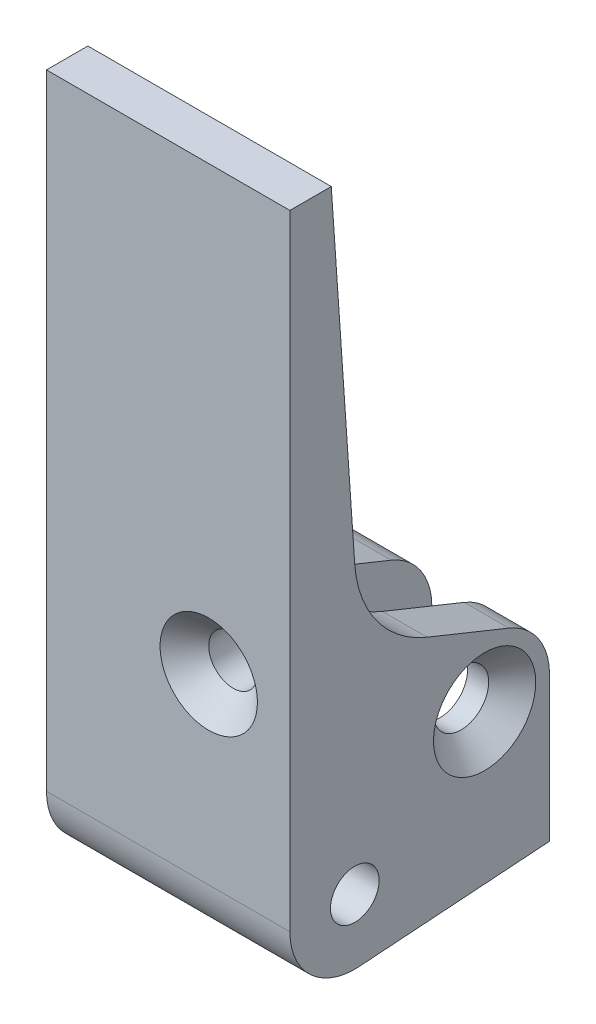
ISO-10303-21;
HEADER;
FILE_DESCRIPTION(('STEP AP214'),'2;1');
FILE_NAME('part.step','',(''),(''),'','','');
FILE_SCHEMA(('AUTOMOTIVE_DESIGN { 1 0 10303 214 1 1 1 1 }'));
ENDSEC;
DATA;
#1=APPLICATION_CONTEXT('core data for automotive mechanical design processes');
#2=APPLICATION_PROTOCOL_DEFINITION('international standard','automotive_design',2000,#1);
#3=PRODUCT_CONTEXT('',#1,'mechanical');
#4=PRODUCT('Part','Part','',(#3));
#5=PRODUCT_RELATED_PRODUCT_CATEGORY('part','',(#4));
#6=PRODUCT_DEFINITION_FORMATION('','',#4);
#7=PRODUCT_DEFINITION_CONTEXT('part definition',#1,'design');
#8=PRODUCT_DEFINITION('design','',#6,#7);
#9=PRODUCT_DEFINITION_SHAPE('','',#8);
#10=(LENGTH_UNIT() NAMED_UNIT(*) SI_UNIT(.MILLI.,.METRE.));
#11=(NAMED_UNIT(*) PLANE_ANGLE_UNIT() SI_UNIT($,.RADIAN.));
#12=(NAMED_UNIT(*) SI_UNIT($,.STERADIAN.) SOLID_ANGLE_UNIT());
#13=UNCERTAINTY_MEASURE_WITH_UNIT(LENGTH_MEASURE(1.E-05),#10,'distance_accuracy_value','');
#14=(GEOMETRIC_REPRESENTATION_CONTEXT(3) GLOBAL_UNCERTAINTY_ASSIGNED_CONTEXT((#13)) GLOBAL_UNIT_ASSIGNED_CONTEXT((#10,
#11,#12)) REPRESENTATION_CONTEXT('',''));
#15=CARTESIAN_POINT('',(0.,0.,0.));
#16=DIRECTION('',(0.,0.,1.));
#17=DIRECTION('',(1.,0.,0.));
#18=AXIS2_PLACEMENT_3D('',#15,#16,#17);
#19=CARTESIAN_POINT('',(4.7833911777,-22.5652643177,178.13));
#20=DIRECTION('',(1.,0.,0.));
#21=DIRECTION('',(0.,0.,-1.));
#22=AXIS2_PLACEMENT_3D('',#19,#20,#21);
#23=CYLINDRICAL_SURFACE('',#22,1.7);
#24=CARTESIAN_POINT('',(3.33339117764808,-22.5652643177,178.13));
#25=DIRECTION('',(1.,0.,0.));
#26=DIRECTION('',(0.,-1.,0.));
#27=AXIS2_PLACEMENT_3D('',#24,#25,#26);
#28=CIRCLE('',#27,1.70000000000526);
#29=CARTESIAN_POINT('',(3.33339117764808,-24.2652643177053,178.13));
#30=VERTEX_POINT('',#29);
#31=EDGE_CURVE('E153',#30,#30,#28,.T.);
#32=ORIENTED_EDGE('',*,*,#31,.T.);
#33=EDGE_LOOP('',(#32));
#34=FACE_BOUND('',#33,.T.);
#35=CARTESIAN_POINT('',(2.0333911777,-22.5652643177,178.13));
#36=DIRECTION('',(1.,0.,0.));
#37=DIRECTION('',(0.,0.,-1.));
#38=AXIS2_PLACEMENT_3D('',#35,#36,#37);
#39=CIRCLE('',#38,1.7);
#40=CARTESIAN_POINT('',(2.0333911777,-22.5652643177,176.43));
#41=VERTEX_POINT('',#40);
#42=EDGE_CURVE('E19',#41,#41,#39,.T.);
#43=ORIENTED_EDGE('',*,*,#42,.F.);
#44=EDGE_LOOP('',(#43));
#45=FACE_BOUND('',#44,.T.);
#46=ADVANCED_FACE('F16',(#34,#45),#23,.F.);
#47=CARTESIAN_POINT('',(-2.4666088223,-7.5652643177,174.13));
#48=DIRECTION('',(1.,0.,0.));
#49=DIRECTION('',(0.,0.,-1.));
#50=AXIS2_PLACEMENT_3D('',#47,#48,#49);
#51=PLANE('',#50);
#52=CARTESIAN_POINT('',(-2.4666088223,-22.5652643177,178.13));
#53=DIRECTION('',(-1.,0.,0.));
#54=DIRECTION('',(0.,0.,1.));
#55=AXIS2_PLACEMENT_3D('',#52,#53,#54);
#56=CIRCLE('',#55,1.23);
#57=CARTESIAN_POINT('',(-2.4666088223,-22.5652643177,179.36));
#58=VERTEX_POINT('',#57);
#59=EDGE_CURVE('E141',#58,#58,#56,.T.);
#60=ORIENTED_EDGE('',*,*,#59,.T.);
#61=EDGE_LOOP('',(#60));
#62=FACE_BOUND('',#61,.T.);
#63=DIRECTION('',(0.,1.,0.));
#64=VECTOR('',#63,1.);
#65=CARTESIAN_POINT('',(-2.4666088223,-7.5652643177,183.63));
#66=LINE('',#65,#64);
#67=CARTESIAN_POINT('',(-2.4666088223,-32.1500925049505,183.63));
#68=VERTEX_POINT('',#67);
#69=CARTESIAN_POINT('',(-2.4666088223,-15.6375789270996,183.63));
#70=VERTEX_POINT('',#69);
#71=EDGE_CURVE('E167',#68,#70,#66,.T.);
#72=ORIENTED_EDGE('',*,*,#71,.F.);
#73=DIRECTION('',(0.,0.0698111742334551,-0.99756022372193));
#74=VECTOR('',#73,1.);
#75=CARTESIAN_POINT('',(-2.4666088223,-32.30550521258,185.85075530306));
#76=LINE('',#75,#74);
#77=CARTESIAN_POINT('',(-2.4666088223,-31.4852643176952,174.13));
#78=VERTEX_POINT('',#77);
#79=EDGE_CURVE('E152',#78,#68,#76,.F.);
#80=ORIENTED_EDGE('',*,*,#79,.F.);
#81=DIRECTION('',(0.,1.,0.));
#82=VECTOR('',#81,1.);
#83=CARTESIAN_POINT('',(-2.4666088223,-31.4852643177,174.13));
#84=LINE('',#83,#82);
#85=CARTESIAN_POINT('',(-2.4666088223,-22.5652643177,174.13));
#86=VERTEX_POINT('',#85);
#87=EDGE_CURVE('E142',#86,#78,#84,.F.);
#88=ORIENTED_EDGE('',*,*,#87,.F.);
#89=CARTESIAN_POINT('',(-2.4666088223,-22.5652643177,178.13));
#90=DIRECTION('',(1.,0.,0.));
#91=DIRECTION('',(0.,0.,-1.));
#92=AXIS2_PLACEMENT_3D('',#89,#90,#91);
#93=CIRCLE('',#92,4.);
#94=CARTESIAN_POINT('',(-2.4666088223,-18.8565288994314,176.631573626333));
#95=VERTEX_POINT('',#94);
#96=EDGE_CURVE('E146',#95,#86,#93,.F.);
#97=ORIENTED_EDGE('',*,*,#96,.F.);
#98=DIRECTION('',(0.,0.374606593415914,0.927183854566787));
#99=VECTOR('',#98,1.);
#100=CARTESIAN_POINT('',(-2.4666088223,-18.85652889943,176.63157362633));
#101=LINE('',#100,#99);
#102=CARTESIAN_POINT('',(-2.4666088223,-16.8165288994311,181.680750807302));
#103=VERTEX_POINT('',#102);
#104=EDGE_CURVE('E104',#103,#95,#101,.F.);
#105=ORIENTED_EDGE('',*,*,#104,.F.);
#106=CARTESIAN_POINT('',(-2.4666088223,-10.18716433928,179.00231366438));
#107=DIRECTION('',(1.,0.,0.));
#108=DIRECTION('',(0.,0.,-1.));
#109=AXIS2_PLACEMENT_3D('',#106,#107,#108);
#110=CIRCLE('',#109,7.15);
#111=EDGE_CURVE('E122',#103,#70,#110,.F.);
#112=ORIENTED_EDGE('',*,*,#111,.T.);
#113=EDGE_LOOP('',(#72,#80,#88,#97,#105,#112));
#114=FACE_BOUND('',#113,.T.);
#115=ADVANCED_FACE('F423',(#62,#114),#51,.T.);
#116=CARTESIAN_POINT('',(-2.4666088223,-7.5652643177,183.63));
#117=DIRECTION('',(0.,0.,-1.));
#118=DIRECTION('',(-1.,0.,0.));
#119=AXIS2_PLACEMENT_3D('',#116,#117,#118);
#120=PLANE('',#119);
#121=DIRECTION('',(0.,1.,0.));
#122=VECTOR('',#121,1.);
#123=CARTESIAN_POINT('',(2.0333911777,-37.5652643177,183.63));
#124=LINE('',#123,#122);
#125=CARTESIAN_POINT('',(2.0333911777,-32.1500925049505,183.63));
#126=VERTEX_POINT('',#125);
#127=CARTESIAN_POINT('',(2.0333911777,-15.6375789270996,183.63));
#128=VERTEX_POINT('',#127);
#129=EDGE_CURVE('E165',#126,#128,#124,.T.);
#130=ORIENTED_EDGE('',*,*,#129,.F.);
#131=DIRECTION('',(1.,0.,0.));
#132=VECTOR('',#131,1.);
#133=CARTESIAN_POINT('',(4.7833911777,-32.1500925049508,183.63));
#134=LINE('',#133,#132);
#135=EDGE_CURVE('E172',#68,#126,#134,.T.);
#136=ORIENTED_EDGE('',*,*,#135,.F.);
#137=ORIENTED_EDGE('',*,*,#71,.T.);
#138=DIRECTION('',(1.,0.,0.));
#139=VECTOR('',#138,1.);
#140=CARTESIAN_POINT('',(4.7833911777,-15.6375789270997,183.63));
#141=LINE('',#140,#139);
#142=CARTESIAN_POINT('',(-0.676733180997008,-15.6375789270997,183.63));
#143=VERTEX_POINT('',#142);
#144=EDGE_CURVE('E93',#70,#143,#141,.T.);
#145=ORIENTED_EDGE('',*,*,#144,.T.);
#146=CARTESIAN_POINT('',(-0.216608822299998,-17.0652643177,183.63));
#147=DIRECTION('',(0.,0.,-1.));
#148=DIRECTION('',(-1.,0.,0.));
#149=AXIS2_PLACEMENT_3D('',#146,#147,#148);
#150=CIRCLE('',#149,1.5);
#151=CARTESIAN_POINT('',(0.243515536398897,-15.6375789271003,183.629999999999));
#152=VERTEX_POINT('',#151);
#153=EDGE_CURVE('E95',#143,#152,#150,.F.);
#154=ORIENTED_EDGE('',*,*,#153,.T.);
#155=DIRECTION('',(1.,0.,0.));
#156=VECTOR('',#155,1.);
#157=CARTESIAN_POINT('',(4.7833911777,-15.6375789270997,183.63));
#158=LINE('',#157,#156);
#159=EDGE_CURVE('E100',#152,#128,#158,.T.);
#160=ORIENTED_EDGE('',*,*,#159,.T.);
#161=EDGE_LOOP('',(#130,#136,#137,#145,#154,#160));
#162=FACE_BOUND('',#161,.T.);
#163=ADVANCED_FACE('F98',(#162),#120,.T.);
#164=CARTESIAN_POINT('',(2.0333911777,-37.5652643177,174.13));
#165=DIRECTION('',(-1.,0.,0.));
#166=DIRECTION('',(0.,0.,1.));
#167=AXIS2_PLACEMENT_3D('',#164,#165,#166);
#168=PLANE('',#167);
#169=ORIENTED_EDGE('',*,*,#42,.T.);
#170=EDGE_LOOP('',(#169));
#171=FACE_BOUND('',#170,.T.);
#172=DIRECTION('',(0.,0.374606593415914,0.927183854566787));
#173=VECTOR('',#172,1.);
#174=CARTESIAN_POINT('',(2.0333911777,-18.85652889943,176.63157362633));
#175=LINE('',#174,#173);
#176=CARTESIAN_POINT('',(2.0333911777,-18.8565288994314,176.631573626333));
#177=VERTEX_POINT('',#176);
#178=CARTESIAN_POINT('',(2.0333911777,-16.8165288994292,181.680750807301));
#179=VERTEX_POINT('',#178);
#180=EDGE_CURVE('E115',#177,#179,#175,.T.);
#181=ORIENTED_EDGE('',*,*,#180,.F.);
#182=CARTESIAN_POINT('',(2.0333911777,-22.5652643177,178.13));
#183=DIRECTION('',(1.,0.,0.));
#184=DIRECTION('',(0.,0.,-1.));
#185=AXIS2_PLACEMENT_3D('',#182,#183,#184);
#186=CIRCLE('',#185,4.);
#187=CARTESIAN_POINT('',(2.0333911777,-22.5652643177,174.13));
#188=VERTEX_POINT('',#187);
#189=EDGE_CURVE('E233',#188,#177,#186,.T.);
#190=ORIENTED_EDGE('',*,*,#189,.F.);
#191=DIRECTION('',(0.,1.,0.));
#192=VECTOR('',#191,1.);
#193=CARTESIAN_POINT('',(2.0333911777,-31.4852643177,174.13));
#194=LINE('',#193,#192);
#195=CARTESIAN_POINT('',(2.0333911777,-31.4852643176976,174.13));
#196=VERTEX_POINT('',#195);
#197=EDGE_CURVE('E159',#196,#188,#194,.T.);
#198=ORIENTED_EDGE('',*,*,#197,.F.);
#199=DIRECTION('',(0.,0.0698111742334551,-0.99756022372193));
#200=VECTOR('',#199,1.);
#201=CARTESIAN_POINT('',(2.0333911777,-32.30550521258,185.85075530306));
#202=LINE('',#201,#200);
#203=EDGE_CURVE('E126',#126,#196,#202,.T.);
#204=ORIENTED_EDGE('',*,*,#203,.F.);
#205=ORIENTED_EDGE('',*,*,#129,.T.);
#206=CARTESIAN_POINT('',(2.0333911777,-10.18716433928,179.00231366438));
#207=DIRECTION('',(1.,0.,0.));
#208=DIRECTION('',(0.,0.,-1.));
#209=AXIS2_PLACEMENT_3D('',#206,#207,#208);
#210=CIRCLE('',#209,7.15);
#211=EDGE_CURVE('E113',#128,#179,#210,.T.);
#212=ORIENTED_EDGE('',*,*,#211,.T.);
#213=EDGE_LOOP('',(#181,#190,#198,#204,#205,#212));
#214=FACE_BOUND('',#213,.T.);
#215=ADVANCED_FACE('F282',(#171,#214),#168,.T.);
#216=CARTESIAN_POINT('',(-0.2166088223,-17.0652643177,174.13));
#217=DIRECTION('',(0.,0.,-1.));
#218=DIRECTION('',(-1.,0.,0.));
#219=AXIS2_PLACEMENT_3D('',#216,#217,#218);
#220=CYLINDRICAL_SURFACE('',#219,1.5);
#221=CARTESIAN_POINT('',(-0.676733181001063,-15.637578927101,183.629999999998));
#222=CARTESIAN_POINT('',(-0.650771673570297,-15.629211048905,183.639855117339));
#223=CARTESIAN_POINT('',(-0.624316941741797,-15.6214685913466,183.648920446191));
#224=CARTESIAN_POINT('',(-0.570524402255945,-15.6073485935759,183.665383529604));
#225=CARTESIAN_POINT('',(-0.543186156110636,-15.6009717434693,183.672780441137));
#226=CARTESIAN_POINT('',(-0.460178960592109,-15.5841006381388,183.692290320695));
#227=CARTESIAN_POINT('',(-0.403387540746469,-15.5758231451973,183.701772241588));
#228=CARTESIAN_POINT('',(-0.288284372336391,-15.5658593146001,183.713173496685));
#229=CARTESIAN_POINT('',(-0.22996782855515,-15.5641971607047,183.715065083034));
#230=CARTESIAN_POINT('',(-0.113811856029325,-15.5676649618612,183.711105336005));
#231=CARTESIAN_POINT('',(-0.0559722209989535,-15.5727918064788,183.705257548483));
#232=CARTESIAN_POINT('',(0.0427993259321904,-15.5872523306482,183.688637855935));
#233=CARTESIAN_POINT('',(0.0842404756621355,-15.5951578396799,183.679527414588));
#234=CARTESIAN_POINT('',(0.165336078860807,-15.6141053053487,183.657526989911));
#235=CARTESIAN_POINT('',(0.204991823832572,-15.6251449512059,183.644639790937));
#236=CARTESIAN_POINT('',(0.24351553640106,-15.637578927101,183.629999999998));
#237=B_SPLINE_CURVE_WITH_KNOTS('',3,(#221,#222,#223,#224,#225,#226,#227,#228,#229,#230,#231,
#232,#233,#234,#235,#236),.UNSPECIFIED.,.F.,.F.,(4,2,2,2,2,2,2,4),(0.,0.0869672276078167,
0.173978300677935,0.347568835720363,0.521793387681531,0.695938144875291,0.825114326468509,
0.954195513505102),.UNSPECIFIED.);
#238=EDGE_CURVE('E105',#143,#152,#237,.T.);
#239=ORIENTED_EDGE('',*,*,#238,.T.);
#240=ORIENTED_EDGE('',*,*,#153,.F.);
#241=EDGE_LOOP('',(#239,#240));
#242=FACE_BOUND('',#241,.T.);
#243=CARTESIAN_POINT('',(-0.2166088223,-17.0652643177,188.629999999989));
#244=DIRECTION('',(0.,0.,1.));
#245=DIRECTION('',(0.,-1.,0.));
#246=AXIS2_PLACEMENT_3D('',#243,#244,#245);
#247=CIRCLE('',#246,1.50000000001499);
#248=CARTESIAN_POINT('',(-0.216608822299996,-18.565264317715,188.629999999989));
#249=VERTEX_POINT('',#248);
#250=EDGE_CURVE('E131',#249,#249,#247,.T.);
#251=ORIENTED_EDGE('',*,*,#250,.T.);
#252=EDGE_LOOP('',(#251));
#253=FACE_BOUND('',#252,.T.);
#254=ADVANCED_FACE('F106',(#242,#253),#220,.F.);
#255=CARTESIAN_POINT('',(4.7833911777,-18.85652889943,176.63157362633));
#256=DIRECTION('',(0.,0.927183854566787,-0.374606593415914));
#257=DIRECTION('',(0.,0.374606593415914,0.927183854566787));
#258=AXIS2_PLACEMENT_3D('',#255,#256,#257);
#259=PLANE('',#258);
#260=DIRECTION('',(0.,-0.374606593415863,-0.927183854566807));
#261=VECTOR('',#260,1.);
#262=CARTESIAN_POINT('',(-10.2166088223,-16.81652889943,181.6807508073));
#263=LINE('',#262,#261);
#264=CARTESIAN_POINT('',(-10.2166088223,-16.8165288994313,181.680750807302));
#265=VERTEX_POINT('',#264);
#266=CARTESIAN_POINT('',(-10.2166088223,-18.8565288994314,176.631573626333));
#267=VERTEX_POINT('',#266);
#268=EDGE_CURVE('E228',#265,#267,#263,.T.);
#269=ORIENTED_EDGE('',*,*,#268,.F.);
#270=DIRECTION('',(1.,0.,0.));
#271=VECTOR('',#270,1.);
#272=CARTESIAN_POINT('',(4.7833911777,-16.8165288994335,181.680750807301));
#273=LINE('',#272,#271);
#274=EDGE_CURVE('E125',#265,#103,#273,.T.);
#275=ORIENTED_EDGE('',*,*,#274,.T.);
#276=ORIENTED_EDGE('',*,*,#104,.T.);
#277=DIRECTION('',(1.,0.,0.));
#278=VECTOR('',#277,1.);
#279=CARTESIAN_POINT('',(4.7833911777,-18.8565288994347,176.631573626332));
#280=LINE('',#279,#278);
#281=EDGE_CURVE('E143',#267,#95,#280,.T.);
#282=ORIENTED_EDGE('',*,*,#281,.F.);
#283=EDGE_LOOP('',(#269,#275,#276,#282));
#284=FACE_BOUND('',#283,.T.);
#285=ADVANCED_FACE('F274',(#284),#259,.T.);
#286=CARTESIAN_POINT('',(4.7833911777,-22.5652643177,178.13));
#287=DIRECTION('',(1.,0.,0.));
#288=DIRECTION('',(0.,0.,-1.));
#289=AXIS2_PLACEMENT_3D('',#286,#287,#288);
#290=CYLINDRICAL_SURFACE('',#289,4.);
#291=ORIENTED_EDGE('',*,*,#281,.T.);
#292=ORIENTED_EDGE('',*,*,#96,.T.);
#293=DIRECTION('',(-1.,0.,0.));
#294=VECTOR('',#293,1.);
#295=CARTESIAN_POINT('',(4.7833911777,-22.5652643177,174.13));
#296=LINE('',#295,#294);
#297=CARTESIAN_POINT('',(-10.2166088223,-22.5652643177,174.13));
#298=VERTEX_POINT('',#297);
#299=EDGE_CURVE('E138',#298,#86,#296,.F.);
#300=ORIENTED_EDGE('',*,*,#299,.F.);
#301=CARTESIAN_POINT('',(-10.2166088223,-22.5652643177,178.13));
#302=DIRECTION('',(1.,0.,0.));
#303=DIRECTION('',(0.,0.,-1.));
#304=AXIS2_PLACEMENT_3D('',#301,#302,#303);
#305=CIRCLE('',#304,4.);
#306=EDGE_CURVE('E225',#267,#298,#305,.F.);
#307=ORIENTED_EDGE('',*,*,#306,.F.);
#308=EDGE_LOOP('',(#291,#292,#300,#307));
#309=FACE_BOUND('',#308,.T.);
#310=ADVANCED_FACE('F271',(#309),#290,.T.);
#311=CARTESIAN_POINT('',(4.7833911777,-31.4852643177,174.13));
#312=DIRECTION('',(0.,0.,-1.));
#313=DIRECTION('',(-1.,0.,0.));
#314=AXIS2_PLACEMENT_3D('',#311,#312,#313);
#315=PLANE('',#314);
#316=DIRECTION('',(0.,1.,0.));
#317=VECTOR('',#316,1.);
#318=CARTESIAN_POINT('',(-10.2166088223,-32.30550521258,174.13));
#319=LINE('',#318,#317);
#320=CARTESIAN_POINT('',(-10.2166088223,-31.4852643176976,174.13));
#321=VERTEX_POINT('',#320);
#322=EDGE_CURVE('E224',#298,#321,#319,.F.);
#323=ORIENTED_EDGE('',*,*,#322,.F.);
#324=ORIENTED_EDGE('',*,*,#299,.T.);
#325=ORIENTED_EDGE('',*,*,#87,.T.);
#326=DIRECTION('',(1.,0.,0.));
#327=VECTOR('',#326,1.);
#328=CARTESIAN_POINT('',(4.7833911777,-31.4852643176928,174.130000000001));
#329=LINE('',#328,#327);
#330=EDGE_CURVE('E149',#321,#78,#329,.T.);
#331=ORIENTED_EDGE('',*,*,#330,.F.);
#332=EDGE_LOOP('',(#323,#324,#325,#331));
#333=FACE_BOUND('',#332,.T.);
#334=ADVANCED_FACE('F267',(#333),#315,.T.);
#335=CARTESIAN_POINT('',(-10.2166088223,-22.5652643177,178.13));
#336=DIRECTION('',(-1.,0.,0.));
#337=DIRECTION('',(0.,0.,1.));
#338=AXIS2_PLACEMENT_3D('',#335,#336,#337);
#339=CYLINDRICAL_SURFACE('',#338,1.23);
#340=ORIENTED_EDGE('',*,*,#59,.F.);
#341=EDGE_LOOP('',(#340));
#342=FACE_BOUND('',#341,.T.);
#343=CARTESIAN_POINT('',(-10.2166088223,-22.5652643177,178.13));
#344=DIRECTION('',(-1.,0.,0.));
#345=DIRECTION('',(0.,0.,1.));
#346=AXIS2_PLACEMENT_3D('',#343,#344,#345);
#347=CIRCLE('',#346,1.23);
#348=CARTESIAN_POINT('',(-10.2166088223,-22.5652643177,179.36));
#349=VERTEX_POINT('',#348);
#350=EDGE_CURVE('E218',#349,#349,#347,.F.);
#351=ORIENTED_EDGE('',*,*,#350,.F.);
#352=EDGE_LOOP('',(#351));
#353=FACE_BOUND('',#352,.T.);
#354=ADVANCED_FACE('F263',(#342,#353),#339,.F.);
#355=CARTESIAN_POINT('',(4.78339117768201,-22.5652643177,178.13));
#356=DIRECTION('',(1.,0.,0.));
#357=DIRECTION('',(0.,0.,-1.));
#358=AXIS2_PLACEMENT_3D('',#355,#356,#357);
#359=CONICAL_SURFACE('',#358,3.15000000003918,0.785398163397448);
#360=CARTESIAN_POINT('',(4.78339117768201,-22.5652643177,178.13));
#361=DIRECTION('',(1.,0.,0.));
#362=DIRECTION('',(0.,0.,-1.));
#363=AXIS2_PLACEMENT_3D('',#360,#361,#362);
#364=CIRCLE('',#363,3.15000000003918);
#365=CARTESIAN_POINT('',(4.78339117768201,-22.5652643177,174.979999999961));
#366=VERTEX_POINT('',#365);
#367=EDGE_CURVE('E136',#366,#366,#364,.T.);
#368=ORIENTED_EDGE('',*,*,#367,.T.);
#369=EDGE_LOOP('',(#368));
#370=FACE_BOUND('',#369,.T.);
#371=ORIENTED_EDGE('',*,*,#31,.F.);
#372=EDGE_LOOP('',(#371));
#373=FACE_BOUND('',#372,.T.);
#374=ADVANCED_FACE('F259',(#370,#373),#359,.F.);
#375=CARTESIAN_POINT('',(4.7833911777,-32.30550521258,185.85075530306));
#376=DIRECTION('',(0.,-0.99756022372193,-0.0698111742334551));
#377=DIRECTION('',(0.,0.0698111742334551,-0.99756022372193));
#378=AXIS2_PLACEMENT_3D('',#375,#376,#377);
#379=PLANE('',#378);
#380=ORIENTED_EDGE('',*,*,#203,.T.);
#381=DIRECTION('',(-1.,0.,0.));
#382=VECTOR('',#381,1.);
#383=CARTESIAN_POINT('',(4.7833911777,-31.4852643177,174.13));
#384=LINE('',#383,#382);
#385=CARTESIAN_POINT('',(4.7833911777,-31.4852643177,174.13));
#386=VERTEX_POINT('',#385);
#387=EDGE_CURVE('E162',#386,#196,#384,.T.);
#388=ORIENTED_EDGE('',*,*,#387,.F.);
#389=DIRECTION('',(0.,-0.0698111742328396,0.997560223721973));
#390=VECTOR('',#389,1.);
#391=CARTESIAN_POINT('',(4.7833911777,-31.4852643177,174.13));
#392=LINE('',#391,#390);
#393=CARTESIAN_POINT('',(4.7833911777,-32.3055052125839,185.850755303064));
#394=VERTEX_POINT('',#393);
#395=EDGE_CURVE('E213',#386,#394,#392,.T.);
#396=ORIENTED_EDGE('',*,*,#395,.T.);
#397=DIRECTION('',(1.,0.,0.));
#398=VECTOR('',#397,1.);
#399=CARTESIAN_POINT('',(4.7833911777,-32.3055052125872,185.850755303059));
#400=LINE('',#399,#398);
#401=CARTESIAN_POINT('',(-10.2166088223,-32.3055052125839,185.850755303064));
#402=VERTEX_POINT('',#401);
#403=EDGE_CURVE('E134',#402,#394,#400,.T.);
#404=ORIENTED_EDGE('',*,*,#403,.F.);
#405=DIRECTION('',(0.,-0.0698111742328396,0.997560223721973));
#406=VECTOR('',#405,1.);
#407=CARTESIAN_POINT('',(-10.2166088223,-31.4852643177,174.13));
#408=LINE('',#407,#406);
#409=EDGE_CURVE('E130',#321,#402,#408,.T.);
#410=ORIENTED_EDGE('',*,*,#409,.F.);
#411=ORIENTED_EDGE('',*,*,#330,.T.);
#412=ORIENTED_EDGE('',*,*,#79,.T.);
#413=ORIENTED_EDGE('',*,*,#135,.T.);
#414=EDGE_LOOP('',(#380,#388,#396,#404,#410,#411,#412,#413));
#415=FACE_BOUND('',#414,.T.);
#416=ADVANCED_FACE('F255',(#415),#379,.T.);
#417=CARTESIAN_POINT('',(4.7833911777,-10.68105375318,186.1352354533));
#418=DIRECTION('',(0.,0.0690754425045223,-0.9976114390096));
#419=DIRECTION('',(0.,0.9976114390096,0.0690754425045223));
#420=AXIS2_PLACEMENT_3D('',#417,#418,#419);
#421=PLANE('',#420);
#422=DIRECTION('',(1.,0.,0.));
#423=VECTOR('',#422,1.);
#424=CARTESIAN_POINT('',(4.7833911777,10.1847356823,187.58));
#425=LINE('',#424,#423);
#426=CARTESIAN_POINT('',(4.7833911777,10.1847356823,187.58));
#427=VERTEX_POINT('',#426);
#428=CARTESIAN_POINT('',(-10.2166088223,10.1847356823,187.58));
#429=VERTEX_POINT('',#428);
#430=EDGE_CURVE('E127',#427,#429,#425,.F.);
#431=ORIENTED_EDGE('',*,*,#430,.F.);
#432=DIRECTION('',(0.,-0.997611439009595,-0.0690754425045941));
#433=VECTOR('',#432,1.);
#434=CARTESIAN_POINT('',(4.7833911777,10.1847356823,187.58));
#435=LINE('',#434,#433);
#436=CARTESIAN_POINT('',(4.7833911777,-10.6810537531839,186.135235453299));
#437=VERTEX_POINT('',#436);
#438=EDGE_CURVE('E210',#427,#437,#435,.T.);
#439=ORIENTED_EDGE('',*,*,#438,.T.);
#440=DIRECTION('',(1.,0.,0.));
#441=VECTOR('',#440,1.);
#442=CARTESIAN_POINT('',(4.7833911777,-10.6810537531799,186.135235453299));
#443=LINE('',#442,#441);
#444=CARTESIAN_POINT('',(-10.2166088223,-10.6810537531839,186.135235453299));
#445=VERTEX_POINT('',#444);
#446=EDGE_CURVE('E123',#437,#445,#443,.F.);
#447=ORIENTED_EDGE('',*,*,#446,.T.);
#448=DIRECTION('',(0.,-0.997611439009595,-0.0690754425045941));
#449=VECTOR('',#448,1.);
#450=CARTESIAN_POINT('',(-10.2166088223,10.1847356823,187.58));
#451=LINE('',#450,#449);
#452=EDGE_CURVE('E232',#429,#445,#451,.T.);
#453=ORIENTED_EDGE('',*,*,#452,.F.);
#454=EDGE_LOOP('',(#431,#439,#447,#453));
#455=FACE_BOUND('',#454,.T.);
#456=ADVANCED_FACE('F251',(#455),#421,.T.);
#457=CARTESIAN_POINT('',(4.7833911777,-10.18716433928,179.00231366438));
#458=DIRECTION('',(1.,0.,0.));
#459=DIRECTION('',(0.,0.,-1.));
#460=AXIS2_PLACEMENT_3D('',#457,#458,#459);
#461=CYLINDRICAL_SURFACE('',#460,7.15);
#462=DIRECTION('',(1.,0.,0.));
#463=VECTOR('',#462,1.);
#464=CARTESIAN_POINT('',(4.7833911777,-16.8165288994297,181.6807508073));
#465=LINE('',#464,#463);
#466=CARTESIAN_POINT('',(4.7833911777,-16.8165288994295,181.680750807301));
#467=VERTEX_POINT('',#466);
#468=EDGE_CURVE('E119',#179,#467,#465,.T.);
#469=ORIENTED_EDGE('',*,*,#468,.F.);
#470=ORIENTED_EDGE('',*,*,#211,.F.);
#471=ORIENTED_EDGE('',*,*,#159,.F.);
#472=ORIENTED_EDGE('',*,*,#238,.F.);
#473=ORIENTED_EDGE('',*,*,#144,.F.);
#474=ORIENTED_EDGE('',*,*,#111,.F.);
#475=ORIENTED_EDGE('',*,*,#274,.F.);
#476=CARTESIAN_POINT('',(-10.2166088223,-10.18716433928,179.00231366438));
#477=DIRECTION('',(1.,0.,0.));
#478=DIRECTION('',(0.,0.,-1.));
#479=AXIS2_PLACEMENT_3D('',#476,#477,#478);
#480=CIRCLE('',#479,7.15);
#481=EDGE_CURVE('E229',#445,#265,#480,.T.);
#482=ORIENTED_EDGE('',*,*,#481,.F.);
#483=ORIENTED_EDGE('',*,*,#446,.F.);
#484=CARTESIAN_POINT('',(4.7833911777,-10.18716433928,179.00231366438));
#485=DIRECTION('',(1.,0.,0.));
#486=DIRECTION('',(0.,0.,-1.));
#487=AXIS2_PLACEMENT_3D('',#484,#485,#486);
#488=CIRCLE('',#487,7.15);
#489=EDGE_CURVE('E207',#437,#467,#488,.T.);
#490=ORIENTED_EDGE('',*,*,#489,.T.);
#491=EDGE_LOOP('',(#469,#470,#471,#472,#473,#474,#475,#482,#483,#490));
#492=FACE_BOUND('',#491,.T.);
#493=ADVANCED_FACE('F112',(#492),#461,.F.);
#494=CARTESIAN_POINT('',(4.7833911777,-18.85652889943,176.63157362633));
#495=DIRECTION('',(0.,0.927183854566787,-0.374606593415914));
#496=DIRECTION('',(0.,0.374606593415914,0.927183854566787));
#497=AXIS2_PLACEMENT_3D('',#494,#495,#496);
#498=PLANE('',#497);
#499=ORIENTED_EDGE('',*,*,#180,.T.);
#500=ORIENTED_EDGE('',*,*,#468,.T.);
#501=DIRECTION('',(0.,-0.374606593415863,-0.927183854566807));
#502=VECTOR('',#501,1.);
#503=CARTESIAN_POINT('',(4.7833911777,-16.81652889943,181.6807508073));
#504=LINE('',#503,#502);
#505=CARTESIAN_POINT('',(4.7833911777,-18.8565288994314,176.631573626333));
#506=VERTEX_POINT('',#505);
#507=EDGE_CURVE('E206',#467,#506,#504,.T.);
#508=ORIENTED_EDGE('',*,*,#507,.T.);
#509=DIRECTION('',(1.,0.,0.));
#510=VECTOR('',#509,1.);
#511=CARTESIAN_POINT('',(4.7833911777,-18.8565288994347,176.631573626332));
#512=LINE('',#511,#510);
#513=EDGE_CURVE('E235',#177,#506,#512,.T.);
#514=ORIENTED_EDGE('',*,*,#513,.F.);
#515=EDGE_LOOP('',(#499,#500,#508,#514));
#516=FACE_BOUND('',#515,.T.);
#517=ADVANCED_FACE('F250',(#516),#498,.T.);
#518=CARTESIAN_POINT('',(4.7833911777,-22.5652643177,178.13));
#519=DIRECTION('',(1.,0.,0.));
#520=DIRECTION('',(0.,0.,-1.));
#521=AXIS2_PLACEMENT_3D('',#518,#519,#520);
#522=CYLINDRICAL_SURFACE('',#521,4.);
#523=ORIENTED_EDGE('',*,*,#513,.T.);
#524=CARTESIAN_POINT('',(4.7833911777,-22.5652643177,178.13));
#525=DIRECTION('',(1.,0.,0.));
#526=DIRECTION('',(0.,0.,-1.));
#527=AXIS2_PLACEMENT_3D('',#524,#525,#526);
#528=CIRCLE('',#527,4.);
#529=CARTESIAN_POINT('',(4.7833911777,-22.5652643177,174.13));
#530=VERTEX_POINT('',#529);
#531=EDGE_CURVE('E203',#506,#530,#528,.F.);
#532=ORIENTED_EDGE('',*,*,#531,.T.);
#533=DIRECTION('',(-1.,0.,0.));
#534=VECTOR('',#533,1.);
#535=CARTESIAN_POINT('',(4.7833911777,-22.5652643177,174.13));
#536=LINE('',#535,#534);
#537=EDGE_CURVE('E158',#188,#530,#536,.F.);
#538=ORIENTED_EDGE('',*,*,#537,.F.);
#539=ORIENTED_EDGE('',*,*,#189,.T.);
#540=EDGE_LOOP('',(#523,#532,#538,#539));
#541=FACE_BOUND('',#540,.T.);
#542=ADVANCED_FACE('F318',(#541),#522,.T.);
#543=CARTESIAN_POINT('',(4.7833911777,-31.4852643177,174.13));
#544=DIRECTION('',(0.,0.,-1.));
#545=DIRECTION('',(-1.,0.,0.));
#546=AXIS2_PLACEMENT_3D('',#543,#544,#545);
#547=PLANE('',#546);
#548=ORIENTED_EDGE('',*,*,#197,.T.);
#549=ORIENTED_EDGE('',*,*,#537,.T.);
#550=DIRECTION('',(0.,1.,0.));
#551=VECTOR('',#550,1.);
#552=CARTESIAN_POINT('',(4.7833911777,-32.30550521258,174.13));
#553=LINE('',#552,#551);
#554=EDGE_CURVE('E202',#530,#386,#553,.F.);
#555=ORIENTED_EDGE('',*,*,#554,.T.);
#556=ORIENTED_EDGE('',*,*,#387,.T.);
#557=EDGE_LOOP('',(#548,#549,#555,#556));
#558=FACE_BOUND('',#557,.T.);
#559=ADVANCED_FACE('F315',(#558),#547,.T.);
#560=CARTESIAN_POINT('',(-10.2166088223,-28.3152643177,186.13));
#561=DIRECTION('',(-1.,0.,0.));
#562=DIRECTION('',(0.,0.,1.));
#563=AXIS2_PLACEMENT_3D('',#560,#561,#562);
#564=CYLINDRICAL_SURFACE('',#563,1.5);
#565=CARTESIAN_POINT('',(4.7833911777,-28.3152643177,186.13));
#566=DIRECTION('',(-1.,0.,0.));
#567=DIRECTION('',(0.,0.,1.));
#568=AXIS2_PLACEMENT_3D('',#565,#566,#567);
#569=CIRCLE('',#568,1.5);
#570=CARTESIAN_POINT('',(4.7833911777,-28.3152643177,187.63));
#571=VERTEX_POINT('',#570);
#572=EDGE_CURVE('E199',#571,#571,#569,.F.);
#573=ORIENTED_EDGE('',*,*,#572,.T.);
#574=EDGE_LOOP('',(#573));
#575=FACE_BOUND('',#574,.T.);
#576=CARTESIAN_POINT('',(-10.2166088223,-28.3152643177,186.13));
#577=DIRECTION('',(-1.,0.,0.));
#578=DIRECTION('',(0.,0.,1.));
#579=AXIS2_PLACEMENT_3D('',#576,#577,#578);
#580=CIRCLE('',#579,1.5);
#581=CARTESIAN_POINT('',(-10.2166088223,-28.3152643177,187.63));
#582=VERTEX_POINT('',#581);
#583=EDGE_CURVE('E221',#582,#582,#580,.F.);
#584=ORIENTED_EDGE('',*,*,#583,.F.);
#585=EDGE_LOOP('',(#584));
#586=FACE_BOUND('',#585,.T.);
#587=ADVANCED_FACE('F311',(#575,#586),#564,.F.);
#588=CARTESIAN_POINT('',(-0.2166088223,-17.0652643177,190.12999999984));
#589=DIRECTION('',(0.,0.,1.));
#590=DIRECTION('',(1.,0.,0.));
#591=AXIS2_PLACEMENT_3D('',#588,#589,#590);
#592=CONICAL_SURFACE('',#591,2.99999999986584,0.785398163397448);
#593=CARTESIAN_POINT('',(-0.2166088223,-17.0652643177,190.129999999954));
#594=DIRECTION('',(0.,0.,1.));
#595=DIRECTION('',(1.,0.,0.));
#596=AXIS2_PLACEMENT_3D('',#593,#594,#595);
#597=CIRCLE('',#596,2.99999999997952);
#598=CARTESIAN_POINT('',(2.78339117767952,-17.0652643177,190.129999999954));
#599=VERTEX_POINT('',#598);
#600=EDGE_CURVE('E195',#599,#599,#597,.F.);
#601=ORIENTED_EDGE('',*,*,#600,.F.);
#602=EDGE_LOOP('',(#601));
#603=FACE_BOUND('',#602,.T.);
#604=ORIENTED_EDGE('',*,*,#250,.F.);
#605=EDGE_LOOP('',(#604));
#606=FACE_BOUND('',#605,.T.);
#607=ADVANCED_FACE('F307',(#603,#606),#592,.F.);
#608=CARTESIAN_POINT('',(4.7833911777,10.1847356823,187.58));
#609=DIRECTION('',(0.,1.,0.));
#610=DIRECTION('',(0.,0.,1.));
#611=AXIS2_PLACEMENT_3D('',#608,#609,#610);
#612=PLANE('',#611);
#613=DIRECTION('',(1.,0.,0.));
#614=VECTOR('',#613,1.);
#615=CARTESIAN_POINT('',(4.7833911777,10.1847356823,190.13));
#616=LINE('',#615,#614);
#617=CARTESIAN_POINT('',(4.7833911777,10.1847356823,190.13));
#618=VERTEX_POINT('',#617);
#619=CARTESIAN_POINT('',(-10.2166088223,10.1847356823,190.13));
#620=VERTEX_POINT('',#619);
#621=EDGE_CURVE('E198',#618,#620,#616,.F.);
#622=ORIENTED_EDGE('',*,*,#621,.F.);
#623=DIRECTION('',(0.,0.,1.));
#624=VECTOR('',#623,1.);
#625=CARTESIAN_POINT('',(4.7833911777,10.1847356823,185.85075530306));
#626=LINE('',#625,#624);
#627=EDGE_CURVE('E212',#618,#427,#626,.F.);
#628=ORIENTED_EDGE('',*,*,#627,.T.);
#629=ORIENTED_EDGE('',*,*,#430,.T.);
#630=DIRECTION('',(0.,0.,1.));
#631=VECTOR('',#630,1.);
#632=CARTESIAN_POINT('',(-10.2166088223,10.1847356823,185.85075530306));
#633=LINE('',#632,#631);
#634=EDGE_CURVE('E383',#620,#429,#633,.F.);
#635=ORIENTED_EDGE('',*,*,#634,.F.);
#636=EDGE_LOOP('',(#622,#628,#629,#635));
#637=FACE_BOUND('',#636,.T.);
#638=ADVANCED_FACE('F303',(#637),#612,.T.);
#639=CARTESIAN_POINT('',(-10.2166088223,-32.30550521258,185.85075530306));
#640=DIRECTION('',(-1.,0.,0.));
#641=DIRECTION('',(0.,0.,1.));
#642=AXIS2_PLACEMENT_3D('',#639,#640,#641);
#643=PLANE('',#642);
#644=ORIENTED_EDGE('',*,*,#350,.T.);
#645=EDGE_LOOP('',(#644));
#646=FACE_BOUND('',#645,.T.);
#647=ORIENTED_EDGE('',*,*,#583,.T.);
#648=EDGE_LOOP('',(#647));
#649=FACE_BOUND('',#648,.T.);
#650=ORIENTED_EDGE('',*,*,#306,.T.);
#651=ORIENTED_EDGE('',*,*,#322,.T.);
#652=ORIENTED_EDGE('',*,*,#409,.T.);
#653=CARTESIAN_POINT('',(-10.2166088223,-28.3152643177,186.13));
#654=DIRECTION('',(1.,0.,0.));
#655=DIRECTION('',(0.,0.,-1.));
#656=AXIS2_PLACEMENT_3D('',#653,#654,#655);
#657=CIRCLE('',#656,4.);
#658=CARTESIAN_POINT('',(-10.2166088223,-28.3152643177,190.13));
#659=VERTEX_POINT('',#658);
#660=EDGE_CURVE('E137',#659,#402,#657,.T.);
#661=ORIENTED_EDGE('',*,*,#660,.F.);
#662=DIRECTION('',(0.,1.,0.));
#663=VECTOR('',#662,1.);
#664=CARTESIAN_POINT('',(-10.2166088223,10.1847356823,190.13));
#665=LINE('',#664,#663);
#666=EDGE_CURVE('E359',#620,#659,#665,.F.);
#667=ORIENTED_EDGE('',*,*,#666,.F.);
#668=ORIENTED_EDGE('',*,*,#634,.T.);
#669=ORIENTED_EDGE('',*,*,#452,.T.);
#670=ORIENTED_EDGE('',*,*,#481,.T.);
#671=ORIENTED_EDGE('',*,*,#268,.T.);
#672=EDGE_LOOP('',(#650,#651,#652,#661,#667,#668,#669,#670,#671));
#673=FACE_BOUND('',#672,.T.);
#674=ADVANCED_FACE('F300',(#646,#649,#673),#643,.T.);
#675=CARTESIAN_POINT('',(4.7833911777,-28.3152643177,186.13));
#676=DIRECTION('',(1.,0.,0.));
#677=DIRECTION('',(0.,0.,-1.));
#678=AXIS2_PLACEMENT_3D('',#675,#676,#677);
#679=CYLINDRICAL_SURFACE('',#678,4.);
#680=ORIENTED_EDGE('',*,*,#660,.T.);
#681=ORIENTED_EDGE('',*,*,#403,.T.);
#682=CARTESIAN_POINT('',(4.7833911777,-28.3152643177,186.13));
#683=DIRECTION('',(1.,0.,0.));
#684=DIRECTION('',(0.,0.,-1.));
#685=AXIS2_PLACEMENT_3D('',#682,#683,#684);
#686=CIRCLE('',#685,4.);
#687=CARTESIAN_POINT('',(4.7833911777,-28.3152643177,190.13));
#688=VERTEX_POINT('',#687);
#689=EDGE_CURVE('E34',#394,#688,#686,.F.);
#690=ORIENTED_EDGE('',*,*,#689,.T.);
#691=DIRECTION('',(1.,0.,0.));
#692=VECTOR('',#691,1.);
#693=CARTESIAN_POINT('',(4.7833911777,-28.3152643177,190.13));
#694=LINE('',#693,#692);
#695=EDGE_CURVE('E25',#659,#688,#694,.T.);
#696=ORIENTED_EDGE('',*,*,#695,.F.);
#697=EDGE_LOOP('',(#680,#681,#690,#696));
#698=FACE_BOUND('',#697,.T.);
#699=ADVANCED_FACE('F292',(#698),#679,.T.);
#700=CARTESIAN_POINT('',(4.7833911777,-32.30550521258,185.85075530306));
#701=DIRECTION('',(-1.,0.,0.));
#702=DIRECTION('',(0.,0.,1.));
#703=AXIS2_PLACEMENT_3D('',#700,#701,#702);
#704=PLANE('',#703);
#705=ORIENTED_EDGE('',*,*,#572,.F.);
#706=EDGE_LOOP('',(#705));
#707=FACE_BOUND('',#706,.T.);
#708=ORIENTED_EDGE('',*,*,#531,.F.);
#709=ORIENTED_EDGE('',*,*,#507,.F.);
#710=ORIENTED_EDGE('',*,*,#489,.F.);
#711=ORIENTED_EDGE('',*,*,#438,.F.);
#712=ORIENTED_EDGE('',*,*,#627,.F.);
#713=DIRECTION('',(0.,1.,0.));
#714=VECTOR('',#713,1.);
#715=CARTESIAN_POINT('',(4.7833911777,10.1847356823,190.13));
#716=LINE('',#715,#714);
#717=EDGE_CURVE('E11',#688,#618,#716,.T.);
#718=ORIENTED_EDGE('',*,*,#717,.F.);
#719=ORIENTED_EDGE('',*,*,#689,.F.);
#720=ORIENTED_EDGE('',*,*,#395,.F.);
#721=ORIENTED_EDGE('',*,*,#554,.F.);
#722=EDGE_LOOP('',(#708,#709,#710,#711,#712,#718,#719,#720,#721));
#723=FACE_BOUND('',#722,.T.);
#724=ORIENTED_EDGE('',*,*,#367,.F.);
#725=EDGE_LOOP('',(#724));
#726=FACE_BOUND('',#725,.T.);
#727=ADVANCED_FACE('F286',(#707,#723,#726),#704,.F.);
#728=CARTESIAN_POINT('',(4.7833911777,10.1847356823,190.13));
#729=DIRECTION('',(0.,0.,1.));
#730=DIRECTION('',(1.,0.,0.));
#731=AXIS2_PLACEMENT_3D('',#728,#729,#730);
#732=PLANE('',#731);
#733=ORIENTED_EDGE('',*,*,#695,.T.);
#734=ORIENTED_EDGE('',*,*,#717,.T.);
#735=ORIENTED_EDGE('',*,*,#621,.T.);
#736=ORIENTED_EDGE('',*,*,#666,.T.);
#737=EDGE_LOOP('',(#733,#734,#735,#736));
#738=FACE_BOUND('',#737,.T.);
#739=ORIENTED_EDGE('',*,*,#600,.T.);
#740=EDGE_LOOP('',(#739));
#741=FACE_BOUND('',#740,.T.);
#742=ADVANCED_FACE('F284',(#738,#741),#732,.T.);
#743=CLOSED_SHELL('',(#46,#115,#163,#215,#254,#285,#310,#334,#354,#374,#416,#456,#493,#517,#542,
#559,#587,#607,#638,#674,#699,#727,#742));
#744=MANIFOLD_SOLID_BREP('B1',#743);
#745=ADVANCED_BREP_SHAPE_REPRESENTATION('',(#18,#744),#14);
#746=SHAPE_DEFINITION_REPRESENTATION(#9,#745);
ENDSEC;
END-ISO-10303-21;
